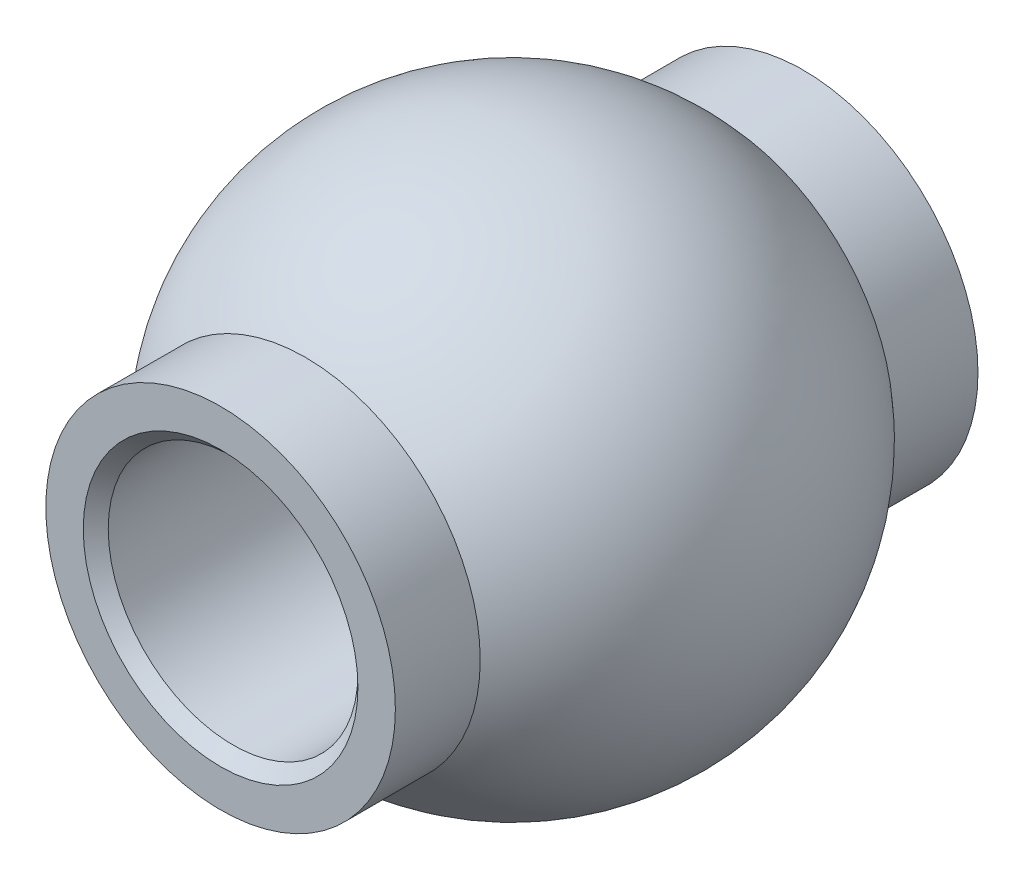
ISO-10303-21;
HEADER;
FILE_DESCRIPTION(('STEP AP214'),'2;1');
FILE_NAME('part.step','',(''),(''),'','','');
FILE_SCHEMA(('AUTOMOTIVE_DESIGN { 1 0 10303 214 1 1 1 1 }'));
ENDSEC;
DATA;
#1=APPLICATION_CONTEXT('core data for automotive mechanical design processes');
#2=APPLICATION_PROTOCOL_DEFINITION('international standard','automotive_design',2000,#1);
#3=PRODUCT_CONTEXT('',#1,'mechanical');
#4=PRODUCT('Part','Part','',(#3));
#5=PRODUCT_RELATED_PRODUCT_CATEGORY('part','',(#4));
#6=PRODUCT_DEFINITION_FORMATION('','',#4);
#7=PRODUCT_DEFINITION_CONTEXT('part definition',#1,'design');
#8=PRODUCT_DEFINITION('design','',#6,#7);
#9=PRODUCT_DEFINITION_SHAPE('','',#8);
#10=(LENGTH_UNIT() NAMED_UNIT(*) SI_UNIT(.MILLI.,.METRE.));
#11=(NAMED_UNIT(*) PLANE_ANGLE_UNIT() SI_UNIT($,.RADIAN.));
#12=(NAMED_UNIT(*) SI_UNIT($,.STERADIAN.) SOLID_ANGLE_UNIT());
#13=UNCERTAINTY_MEASURE_WITH_UNIT(LENGTH_MEASURE(1.E-05),#10,'distance_accuracy_value','');
#14=(GEOMETRIC_REPRESENTATION_CONTEXT(3) GLOBAL_UNCERTAINTY_ASSIGNED_CONTEXT((#13)) GLOBAL_UNIT_ASSIGNED_CONTEXT((#10,
#11,#12)) REPRESENTATION_CONTEXT('',''));
#15=CARTESIAN_POINT('',(0.,0.,0.));
#16=DIRECTION('',(0.,0.,1.));
#17=DIRECTION('',(1.,0.,0.));
#18=AXIS2_PLACEMENT_3D('',#15,#16,#17);
#19=CARTESIAN_POINT('',(0.,19.05,0.));
#20=DIRECTION('',(0.,-1.,0.));
#21=DIRECTION('',(-1.,0.,0.));
#22=AXIS2_PLACEMENT_3D('',#19,#20,#21);
#23=SPHERICAL_SURFACE('',#22,10.31875);
#24=CARTESIAN_POINT('',(0.,19.05,0.));
#25=DIRECTION('',(0.,0.,-1.));
#26=DIRECTION('',(-1.,0.,0.));
#27=AXIS2_PLACEMENT_3D('',#24,#25,#26);
#28=SPHERICAL_SURFACE('',#27,10.31875);
#29=CARTESIAN_POINT('',(0.,19.05,-7.87534413930591));
#30=DIRECTION('',(0.,0.,-1.));
#31=DIRECTION('',(-1.,0.,0.));
#32=AXIS2_PLACEMENT_3D('',#29,#30,#31);
#33=CIRCLE('',#32,6.6675);
#34=CARTESIAN_POINT('',(-6.66750000000001,19.05,-7.87534413930591));
#35=VERTEX_POINT('',#34);
#36=EDGE_CURVE('E55',#35,#35,#33,.F.);
#37=ORIENTED_EDGE('',*,*,#36,.T.);
#38=EDGE_LOOP('',(#37));
#39=FACE_BOUND('',#38,.T.);
#40=CARTESIAN_POINT('',(0.,19.05,7.87534413930591));
#41=DIRECTION('',(0.,0.,1.));
#42=DIRECTION('',(1.,0.,0.));
#43=AXIS2_PLACEMENT_3D('',#40,#41,#42);
#44=CIRCLE('',#43,6.6675);
#45=CARTESIAN_POINT('',(6.66749999999999,19.05,7.87534413930591));
#46=VERTEX_POINT('',#45);
#47=EDGE_CURVE('E58',#46,#46,#44,.F.);
#48=ORIENTED_EDGE('',*,*,#47,.T.);
#49=EDGE_LOOP('',(#48));
#50=FACE_BOUND('',#49,.T.);
#51=ADVANCED_FACE('F35',(#39,#50),#28,.T.);
#52=CARTESIAN_POINT('',(0.,19.05,11.1125));
#53=DIRECTION('',(0.,0.,-1.));
#54=DIRECTION('',(1.,0.,0.));
#55=AXIS2_PLACEMENT_3D('',#52,#53,#54);
#56=CYLINDRICAL_SURFACE('',#55,6.6675);
#57=ORIENTED_EDGE('',*,*,#47,.F.);
#58=EDGE_LOOP('',(#57));
#59=FACE_BOUND('',#58,.T.);
#60=CARTESIAN_POINT('',(0.,19.05,11.1125));
#61=DIRECTION('',(0.,0.,1.));
#62=DIRECTION('',(1.,0.,0.));
#63=AXIS2_PLACEMENT_3D('',#60,#61,#62);
#64=CIRCLE('',#63,6.6675);
#65=CARTESIAN_POINT('',(6.66749999999999,19.05,11.1125));
#66=VERTEX_POINT('',#65);
#67=EDGE_CURVE('E61',#66,#66,#64,.T.);
#68=ORIENTED_EDGE('',*,*,#67,.F.);
#69=EDGE_LOOP('',(#68));
#70=FACE_BOUND('',#69,.T.);
#71=ADVANCED_FACE('F85',(#59,#70),#56,.T.);
#72=CARTESIAN_POINT('',(0.,19.05,11.1125));
#73=DIRECTION('',(0.,0.,-1.));
#74=DIRECTION('',(1.,0.,0.));
#75=AXIS2_PLACEMENT_3D('',#72,#73,#74);
#76=PLANE('',#75);
#77=CARTESIAN_POINT('',(0.,19.05,11.1125));
#78=DIRECTION('',(0.,0.,1.));
#79=DIRECTION('',(1.,0.,0.));
#80=AXIS2_PLACEMENT_3D('',#77,#78,#79);
#81=CIRCLE('',#80,5.23875);
#82=CARTESIAN_POINT('',(-5.23875000000001,19.05,11.1125));
#83=VERTEX_POINT('',#82);
#84=EDGE_CURVE('E50',#83,#83,#81,.T.);
#85=ORIENTED_EDGE('',*,*,#84,.F.);
#86=EDGE_LOOP('',(#85));
#87=FACE_BOUND('',#86,.T.);
#88=ORIENTED_EDGE('',*,*,#67,.T.);
#89=EDGE_LOOP('',(#88));
#90=FACE_BOUND('',#89,.T.);
#91=ADVANCED_FACE('F82',(#87,#90),#76,.F.);
#92=ORIENTED_EDGE('',*,*,#36,.F.);
#93=EDGE_LOOP('',(#92));
#94=FACE_BOUND('',#93,.T.);
#95=CARTESIAN_POINT('',(0.,19.05,-11.1125));
#96=DIRECTION('',(0.,0.,1.));
#97=DIRECTION('',(1.,0.,0.));
#98=AXIS2_PLACEMENT_3D('',#95,#96,#97);
#99=CIRCLE('',#98,6.6675);
#100=CARTESIAN_POINT('',(6.66749999999999,19.05,-11.1125));
#101=VERTEX_POINT('',#100);
#102=EDGE_CURVE('E64',#101,#101,#99,.T.);
#103=ORIENTED_EDGE('',*,*,#102,.T.);
#104=EDGE_LOOP('',(#103));
#105=FACE_BOUND('',#104,.T.);
#106=ADVANCED_FACE('F68',(#94,#105),#56,.T.);
#107=CARTESIAN_POINT('',(0.,19.05,-11.1125));
#108=DIRECTION('',(0.,0.,-1.));
#109=DIRECTION('',(1.,0.,0.));
#110=AXIS2_PLACEMENT_3D('',#107,#108,#109);
#111=PLANE('',#110);
#112=CARTESIAN_POINT('',(0.,19.05,-11.1125));
#113=DIRECTION('',(0.,0.,1.));
#114=DIRECTION('',(1.,0.,0.));
#115=AXIS2_PLACEMENT_3D('',#112,#113,#114);
#116=CIRCLE('',#115,5.23875);
#117=CARTESIAN_POINT('',(5.23874999999999,19.05,-11.1125));
#118=VERTEX_POINT('',#117);
#119=EDGE_CURVE('E10',#118,#118,#116,.F.);
#120=ORIENTED_EDGE('',*,*,#119,.F.);
#121=EDGE_LOOP('',(#120));
#122=FACE_BOUND('',#121,.T.);
#123=ORIENTED_EDGE('',*,*,#102,.F.);
#124=EDGE_LOOP('',(#123));
#125=FACE_BOUND('',#124,.T.);
#126=ADVANCED_FACE('F70',(#122,#125),#111,.T.);
#127=CARTESIAN_POINT('',(0.,19.05,10.31875));
#128=DIRECTION('',(0.,0.,-1.));
#129=DIRECTION('',(1.,0.,0.));
#130=AXIS2_PLACEMENT_3D('',#127,#128,#129);
#131=CYLINDRICAL_SURFACE('',#130,4.7625);
#132=CARTESIAN_POINT('',(0.,19.05,10.63625));
#133=DIRECTION('',(0.,0.,1.));
#134=DIRECTION('',(1.,0.,0.));
#135=AXIS2_PLACEMENT_3D('',#132,#133,#134);
#136=CIRCLE('',#135,4.7625);
#137=CARTESIAN_POINT('',(-4.76250000000001,19.05,10.63625));
#138=VERTEX_POINT('',#137);
#139=EDGE_CURVE('E42',#138,#138,#136,.F.);
#140=ORIENTED_EDGE('',*,*,#139,.F.);
#141=EDGE_LOOP('',(#140));
#142=FACE_BOUND('',#141,.T.);
#143=CARTESIAN_POINT('',(0.,19.05,-10.63625));
#144=DIRECTION('',(0.,0.,1.));
#145=DIRECTION('',(1.,0.,0.));
#146=AXIS2_PLACEMENT_3D('',#143,#144,#145);
#147=CIRCLE('',#146,4.7625);
#148=CARTESIAN_POINT('',(4.76249999999999,19.05,-10.63625));
#149=VERTEX_POINT('',#148);
#150=EDGE_CURVE('E46',#149,#149,#147,.T.);
#151=ORIENTED_EDGE('',*,*,#150,.F.);
#152=EDGE_LOOP('',(#151));
#153=FACE_BOUND('',#152,.T.);
#154=ADVANCED_FACE('F72',(#142,#153),#131,.F.);
#155=CARTESIAN_POINT('',(0.,19.05,11.1125));
#156=DIRECTION('',(0.,0.,1.));
#157=DIRECTION('',(-1.,0.,0.));
#158=AXIS2_PLACEMENT_3D('',#155,#156,#157);
#159=CONICAL_SURFACE('',#158,5.23875,0.785398163397447);
#160=CARTESIAN_POINT('',(-4.76250000000001,19.05,10.63625));
#161=CARTESIAN_POINT('',(-4.76746093750001,19.05,10.6412109375));
#162=CARTESIAN_POINT('',(-4.77242187500001,19.05,10.646171875));
#163=CARTESIAN_POINT('',(-4.78234375000001,19.05,10.65609375));
#164=CARTESIAN_POINT('',(-4.78730468750001,19.05,10.6610546875));
#165=CARTESIAN_POINT('',(-4.79722656250001,19.05,10.6709765625));
#166=CARTESIAN_POINT('',(-4.80218750000001,19.05,10.6759375));
#167=CARTESIAN_POINT('',(-4.81210937500001,19.05,10.685859375));
#168=CARTESIAN_POINT('',(-4.81707031250001,19.05,10.6908203125));
#169=CARTESIAN_POINT('',(-4.82699218750001,19.05,10.7007421875));
#170=CARTESIAN_POINT('',(-4.83195312500001,19.05,10.705703125));
#171=CARTESIAN_POINT('',(-4.84187500000001,19.05,10.715625));
#172=CARTESIAN_POINT('',(-4.84683593750001,19.05,10.7205859375));
#173=CARTESIAN_POINT('',(-4.85675781250001,19.05,10.7305078125));
#174=CARTESIAN_POINT('',(-4.86171875000001,19.05,10.73546875));
#175=CARTESIAN_POINT('',(-4.87164062500001,19.05,10.745390625));
#176=CARTESIAN_POINT('',(-4.87660156250001,19.05,10.7503515625));
#177=CARTESIAN_POINT('',(-4.88652343750001,19.05,10.7602734375));
#178=CARTESIAN_POINT('',(-4.89148437500001,19.05,10.765234375));
#179=CARTESIAN_POINT('',(-4.90140625000001,19.05,10.77515625));
#180=CARTESIAN_POINT('',(-4.90636718750001,19.05,10.7801171875));
#181=CARTESIAN_POINT('',(-4.91628906250001,19.05,10.7900390625));
#182=CARTESIAN_POINT('',(-4.92125000000001,19.05,10.795));
#183=CARTESIAN_POINT('',(-4.93117187500001,19.05,10.804921875));
#184=CARTESIAN_POINT('',(-4.93613281250001,19.05,10.8098828125));
#185=CARTESIAN_POINT('',(-4.94605468750001,19.05,10.8198046875));
#186=CARTESIAN_POINT('',(-4.95101562500001,19.05,10.824765625));
#187=CARTESIAN_POINT('',(-4.96093750000001,19.05,10.8346875));
#188=CARTESIAN_POINT('',(-4.96589843750001,19.05,10.8396484375));
#189=CARTESIAN_POINT('',(-4.97582031250001,19.05,10.8495703125));
#190=CARTESIAN_POINT('',(-4.98078125000001,19.05,10.85453125));
#191=CARTESIAN_POINT('',(-4.99070312500001,19.05,10.864453125));
#192=CARTESIAN_POINT('',(-4.99566406250001,19.05,10.8694140625));
#193=CARTESIAN_POINT('',(-5.00558593750001,19.05,10.8793359375));
#194=CARTESIAN_POINT('',(-5.01054687500001,19.05,10.884296875));
#195=CARTESIAN_POINT('',(-5.02046875000001,19.05,10.89421875));
#196=CARTESIAN_POINT('',(-5.02542968750001,19.05,10.8991796875));
#197=CARTESIAN_POINT('',(-5.03535156250001,19.05,10.9091015625));
#198=CARTESIAN_POINT('',(-5.04031250000001,19.05,10.9140625));
#199=CARTESIAN_POINT('',(-5.05023437500001,19.05,10.923984375));
#200=CARTESIAN_POINT('',(-5.05519531250001,19.05,10.9289453125));
#201=CARTESIAN_POINT('',(-5.06511718750001,19.05,10.9388671875));
#202=CARTESIAN_POINT('',(-5.07007812500001,19.05,10.943828125));
#203=CARTESIAN_POINT('',(-5.08000000000001,19.05,10.95375));
#204=CARTESIAN_POINT('',(-5.08496093750001,19.05,10.9587109375));
#205=CARTESIAN_POINT('',(-5.09488281250001,19.05,10.9686328125));
#206=CARTESIAN_POINT('',(-5.09984375000001,19.05,10.97359375));
#207=CARTESIAN_POINT('',(-5.10976562500001,19.05,10.983515625));
#208=CARTESIAN_POINT('',(-5.11472656250001,19.05,10.9884765625));
#209=CARTESIAN_POINT('',(-5.12464843750001,19.05,10.9983984375));
#210=CARTESIAN_POINT('',(-5.12960937500001,19.05,11.003359375));
#211=CARTESIAN_POINT('',(-5.13953125000001,19.05,11.01328125));
#212=CARTESIAN_POINT('',(-5.14449218750001,19.05,11.0182421875));
#213=CARTESIAN_POINT('',(-5.15441406250001,19.05,11.0281640625));
#214=CARTESIAN_POINT('',(-5.15937500000001,19.05,11.033125));
#215=CARTESIAN_POINT('',(-5.16929687500001,19.05,11.043046875));
#216=CARTESIAN_POINT('',(-5.17425781250001,19.05,11.0480078125));
#217=CARTESIAN_POINT('',(-5.18417968750001,19.05,11.0579296875));
#218=CARTESIAN_POINT('',(-5.18914062500001,19.05,11.062890625));
#219=CARTESIAN_POINT('',(-5.19906250000001,19.05,11.0728125));
#220=CARTESIAN_POINT('',(-5.20402343750001,19.05,11.0777734375));
#221=CARTESIAN_POINT('',(-5.21394531250001,19.05,11.0876953125));
#222=CARTESIAN_POINT('',(-5.21890625000001,19.05,11.09265625));
#223=CARTESIAN_POINT('',(-5.22882812500001,19.05,11.102578125));
#224=CARTESIAN_POINT('',(-5.23378906250001,19.05,11.1075390625));
#225=CARTESIAN_POINT('',(-5.23875000000001,19.05,11.1125));
#226=B_SPLINE_CURVE_WITH_KNOTS('',3,(#160,#161,#162,#163,#164,#165,#166,#167,#168,#169,#170,
#171,#172,#173,#174,#175,#176,#177,#178,#179,#180,#181,#182,#183,#184,#185,#186,#187,#188,#189,
#190,#191,#192,#193,#194,#195,#196,#197,#198,#199,#200,#201,#202,#203,#204,#205,#206,#207,#208,
#209,#210,#211,#212,#213,#214,#215,#216,#217,#218,#219,#220,#221,#222,#223,#224,#225),
.UNSPECIFIED.,.F.,.F.,(4,2,2,2,2,2,2,2,2,2,2,2,2,2,2,2,2,2,2,2,2,2,2,2,2,2,2,2,2,2,2,2,4),(0.,
0.0210474752837551,0.0420949505675108,0.0631424258512671,0.0841899011350229,0.105237376418779,
0.126284851702534,0.14733232698629,0.168379802270046,0.189427277553802,0.210474752837558,
0.231522228121313,0.252569703405069,0.273617178688825,0.294664653972581,0.315712129256337,
0.336759604540093,0.357807079823848,0.378854555107604,0.39990203039136,0.420949505675116,
0.441996980958872,0.463044456242627,0.484091931526383,0.505139406810139,0.526186882093895,
0.547234357377652,0.568281832661406,0.589329307945162,0.610376783228918,0.631424258512674,
0.65247173379643,0.673519209080187),.UNSPECIFIED.);
#227=EDGE_CURVE('BSEAM79',#138,#83,#226,.T.);
#228=ORIENTED_EDGE('',*,*,#139,.T.);
#229=ORIENTED_EDGE('',*,*,#84,.T.);
#230=ORIENTED_EDGE('',*,*,#227,.T.);
#231=ORIENTED_EDGE('',*,*,#227,.F.);
#232=EDGE_LOOP('',(#228,#230,#229,#231));
#233=FACE_BOUND('',#232,.T.);
#234=ADVANCED_FACE('F79',(#233),#159,.F.);
#235=CARTESIAN_POINT('',(0.,19.05,-10.63625));
#236=DIRECTION('',(0.,0.,-1.));
#237=DIRECTION('',(1.,0.,0.));
#238=AXIS2_PLACEMENT_3D('',#235,#236,#237);
#239=CONICAL_SURFACE('',#238,4.7625,0.78539816339745);
#240=ORIENTED_EDGE('',*,*,#119,.T.);
#241=EDGE_LOOP('',(#240));
#242=FACE_BOUND('',#241,.T.);
#243=ORIENTED_EDGE('',*,*,#150,.T.);
#244=EDGE_LOOP('',(#243));
#245=FACE_BOUND('',#244,.T.);
#246=ADVANCED_FACE('F37',(#242,#245),#239,.F.);
#247=CLOSED_SHELL('',(#51,#71,#91,#106,#126,#154,#234,#246));
#248=MANIFOLD_SOLID_BREP('B2',#247);
#249=ADVANCED_BREP_SHAPE_REPRESENTATION('',(#18,#248),#14);
#250=SHAPE_DEFINITION_REPRESENTATION(#9,#249);
ENDSEC;
END-ISO-10303-21;
